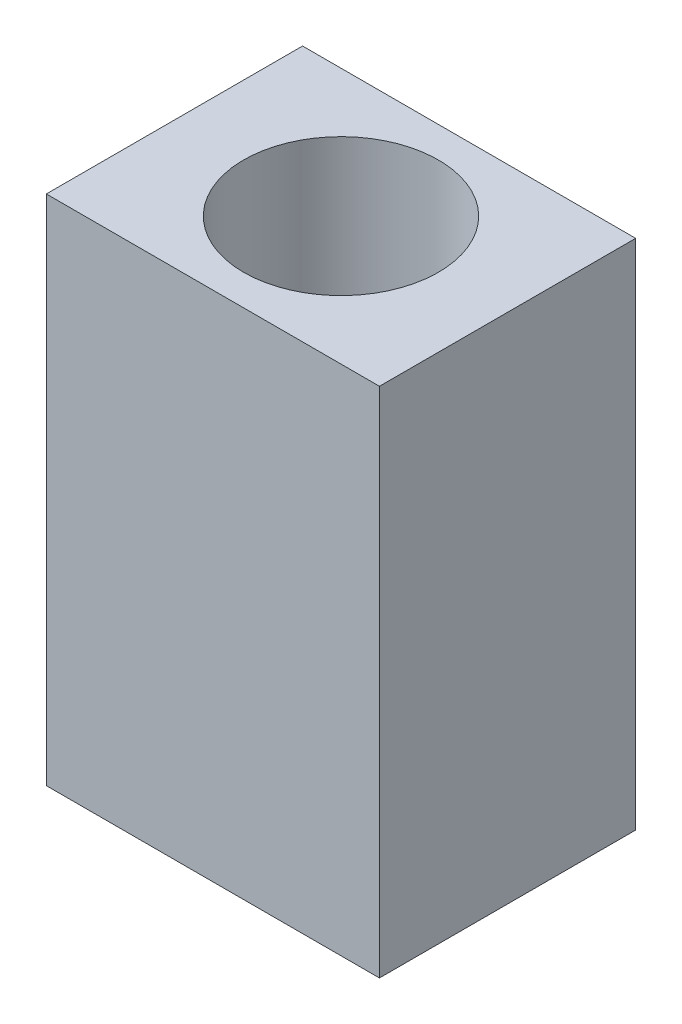
ISO-10303-21;
HEADER;
FILE_DESCRIPTION(('STEP AP214'),'2;1');
FILE_NAME('part.step','',(''),(''),'','','');
FILE_SCHEMA(('AUTOMOTIVE_DESIGN { 1 0 10303 214 1 1 1 1 }'));
ENDSEC;
DATA;
#1=APPLICATION_CONTEXT('core data for automotive mechanical design processes');
#2=APPLICATION_PROTOCOL_DEFINITION('international standard','automotive_design',2000,#1);
#3=PRODUCT_CONTEXT('',#1,'mechanical');
#4=PRODUCT('Part','Part','',(#3));
#5=PRODUCT_RELATED_PRODUCT_CATEGORY('part','',(#4));
#6=PRODUCT_DEFINITION_FORMATION('','',#4);
#7=PRODUCT_DEFINITION_CONTEXT('part definition',#1,'design');
#8=PRODUCT_DEFINITION('design','',#6,#7);
#9=PRODUCT_DEFINITION_SHAPE('','',#8);
#10=(LENGTH_UNIT() NAMED_UNIT(*) SI_UNIT(.MILLI.,.METRE.));
#11=(NAMED_UNIT(*) PLANE_ANGLE_UNIT() SI_UNIT($,.RADIAN.));
#12=(NAMED_UNIT(*) SI_UNIT($,.STERADIAN.) SOLID_ANGLE_UNIT());
#13=UNCERTAINTY_MEASURE_WITH_UNIT(LENGTH_MEASURE(1.E-05),#10,'distance_accuracy_value','');
#14=(GEOMETRIC_REPRESENTATION_CONTEXT(3) GLOBAL_UNCERTAINTY_ASSIGNED_CONTEXT((#13)) GLOBAL_UNIT_ASSIGNED_CONTEXT((#10,
#11,#12)) REPRESENTATION_CONTEXT('',''));
#15=CARTESIAN_POINT('',(0.,0.,0.));
#16=DIRECTION('',(0.,0.,1.));
#17=DIRECTION('',(1.,0.,0.));
#18=AXIS2_PLACEMENT_3D('',#15,#16,#17);
#19=CARTESIAN_POINT('',(0.,0.,10.));
#20=DIRECTION('',(1.,0.,0.));
#21=DIRECTION('',(0.,0.,-1.));
#22=AXIS2_PLACEMENT_3D('',#19,#20,#21);
#23=PLANE('',#22);
#24=DIRECTION('',(0.,-1.,0.));
#25=VECTOR('',#24,1.);
#26=CARTESIAN_POINT('',(0.,0.,0.));
#27=LINE('',#26,#25);
#28=CARTESIAN_POINT('',(0.,20.,0.));
#29=VERTEX_POINT('',#28);
#30=CARTESIAN_POINT('',(0.,0.,0.));
#31=VERTEX_POINT('',#30);
#32=EDGE_CURVE('E96',#29,#31,#27,.T.);
#33=ORIENTED_EDGE('',*,*,#32,.T.);
#34=DIRECTION('',(0.,0.,-1.));
#35=VECTOR('',#34,1.);
#36=CARTESIAN_POINT('',(0.,0.,10.));
#37=LINE('',#36,#35);
#38=CARTESIAN_POINT('',(0.,0.,10.));
#39=VERTEX_POINT('',#38);
#40=EDGE_CURVE('E11',#39,#31,#37,.T.);
#41=ORIENTED_EDGE('',*,*,#40,.F.);
#42=DIRECTION('',(0.,-1.,0.));
#43=VECTOR('',#42,1.);
#44=CARTESIAN_POINT('',(0.,0.,10.));
#45=LINE('',#44,#43);
#46=CARTESIAN_POINT('',(0.,20.,10.));
#47=VERTEX_POINT('',#46);
#48=EDGE_CURVE('E84',#47,#39,#45,.T.);
#49=ORIENTED_EDGE('',*,*,#48,.F.);
#50=DIRECTION('',(0.,0.,-1.));
#51=VECTOR('',#50,1.);
#52=CARTESIAN_POINT('',(0.,20.,10.));
#53=LINE('',#52,#51);
#54=EDGE_CURVE('E92',#47,#29,#53,.T.);
#55=ORIENTED_EDGE('',*,*,#54,.T.);
#56=EDGE_LOOP('',(#33,#41,#49,#55));
#57=FACE_BOUND('',#56,.T.);
#58=ADVANCED_FACE('F33',(#57),#23,.F.);
#59=CARTESIAN_POINT('',(0.,0.,10.));
#60=DIRECTION('',(0.,1.,0.));
#61=DIRECTION('',(0.,0.,1.));
#62=AXIS2_PLACEMENT_3D('',#59,#60,#61);
#63=PLANE('',#62);
#64=DIRECTION('',(1.,0.,0.));
#65=VECTOR('',#64,1.);
#66=CARTESIAN_POINT('',(0.,0.,0.));
#67=LINE('',#66,#65);
#68=CARTESIAN_POINT('',(13.,0.,0.));
#69=VERTEX_POINT('',#68);
#70=EDGE_CURVE('E88',#31,#69,#67,.T.);
#71=ORIENTED_EDGE('',*,*,#70,.T.);
#72=DIRECTION('',(0.,0.,-1.));
#73=VECTOR('',#72,1.);
#74=CARTESIAN_POINT('',(13.,0.,10.));
#75=LINE('',#74,#73);
#76=CARTESIAN_POINT('',(13.,0.,10.));
#77=VERTEX_POINT('',#76);
#78=EDGE_CURVE('E41',#77,#69,#75,.T.);
#79=ORIENTED_EDGE('',*,*,#78,.F.);
#80=DIRECTION('',(1.,0.,0.));
#81=VECTOR('',#80,1.);
#82=CARTESIAN_POINT('',(0.,0.,10.));
#83=LINE('',#82,#81);
#84=EDGE_CURVE('E79',#39,#77,#83,.T.);
#85=ORIENTED_EDGE('',*,*,#84,.F.);
#86=ORIENTED_EDGE('',*,*,#40,.T.);
#87=EDGE_LOOP('',(#71,#79,#85,#86));
#88=FACE_BOUND('',#87,.T.);
#89=ADVANCED_FACE('F87',(#88),#63,.F.);
#90=CARTESIAN_POINT('',(13.,0.,10.));
#91=DIRECTION('',(-1.,0.,0.));
#92=DIRECTION('',(0.,-1.,0.));
#93=AXIS2_PLACEMENT_3D('',#90,#91,#92);
#94=PLANE('',#93);
#95=DIRECTION('',(0.,1.,0.));
#96=VECTOR('',#95,1.);
#97=CARTESIAN_POINT('',(13.,0.,0.));
#98=LINE('',#97,#96);
#99=CARTESIAN_POINT('',(13.,20.,0.));
#100=VERTEX_POINT('',#99);
#101=EDGE_CURVE('E66',#69,#100,#98,.T.);
#102=ORIENTED_EDGE('',*,*,#101,.T.);
#103=DIRECTION('',(0.,0.,-1.));
#104=VECTOR('',#103,1.);
#105=CARTESIAN_POINT('',(13.,20.,10.));
#106=LINE('',#105,#104);
#107=CARTESIAN_POINT('',(13.,20.,10.));
#108=VERTEX_POINT('',#107);
#109=EDGE_CURVE('E89',#108,#100,#106,.T.);
#110=ORIENTED_EDGE('',*,*,#109,.F.);
#111=DIRECTION('',(0.,1.,0.));
#112=VECTOR('',#111,1.);
#113=CARTESIAN_POINT('',(13.,0.,10.));
#114=LINE('',#113,#112);
#115=EDGE_CURVE('E82',#77,#108,#114,.T.);
#116=ORIENTED_EDGE('',*,*,#115,.F.);
#117=ORIENTED_EDGE('',*,*,#78,.T.);
#118=EDGE_LOOP('',(#102,#110,#116,#117));
#119=FACE_BOUND('',#118,.T.);
#120=ADVANCED_FACE('F90',(#119),#94,.F.);
#121=CARTESIAN_POINT('',(0.,20.,10.));
#122=DIRECTION('',(0.,-1.,0.));
#123=DIRECTION('',(0.,0.,-1.));
#124=AXIS2_PLACEMENT_3D('',#121,#122,#123);
#125=PLANE('',#124);
#126=CARTESIAN_POINT('',(6.5,20.,5.));
#127=DIRECTION('',(0.,1.,0.));
#128=DIRECTION('',(0.,0.,1.));
#129=AXIS2_PLACEMENT_3D('',#126,#127,#128);
#130=CIRCLE('',#129,3.8);
#131=CARTESIAN_POINT('',(6.5,20.,8.8));
#132=VERTEX_POINT('',#131);
#133=EDGE_CURVE('E110',#132,#132,#130,.T.);
#134=ORIENTED_EDGE('',*,*,#133,.F.);
#135=EDGE_LOOP('',(#134));
#136=FACE_BOUND('',#135,.T.);
#137=DIRECTION('',(-1.,0.,0.));
#138=VECTOR('',#137,1.);
#139=CARTESIAN_POINT('',(0.,20.,0.));
#140=LINE('',#139,#138);
#141=EDGE_CURVE('E72',#100,#29,#140,.T.);
#142=ORIENTED_EDGE('',*,*,#141,.T.);
#143=ORIENTED_EDGE('',*,*,#54,.F.);
#144=DIRECTION('',(-1.,0.,0.));
#145=VECTOR('',#144,1.);
#146=CARTESIAN_POINT('',(0.,20.,10.));
#147=LINE('',#146,#145);
#148=EDGE_CURVE('E49',#108,#47,#147,.T.);
#149=ORIENTED_EDGE('',*,*,#148,.F.);
#150=ORIENTED_EDGE('',*,*,#109,.T.);
#151=EDGE_LOOP('',(#142,#143,#149,#150));
#152=FACE_BOUND('',#151,.T.);
#153=ADVANCED_FACE('F104',(#136,#152),#125,.F.);
#154=CARTESIAN_POINT('',(0.,0.,10.));
#155=DIRECTION('',(0.,0.,-1.));
#156=DIRECTION('',(-1.,0.,0.));
#157=AXIS2_PLACEMENT_3D('',#154,#155,#156);
#158=PLANE('',#157);
#159=ORIENTED_EDGE('',*,*,#48,.T.);
#160=ORIENTED_EDGE('',*,*,#84,.T.);
#161=ORIENTED_EDGE('',*,*,#115,.T.);
#162=ORIENTED_EDGE('',*,*,#148,.T.);
#163=EDGE_LOOP('',(#159,#160,#161,#162));
#164=FACE_BOUND('',#163,.T.);
#165=ADVANCED_FACE('F80',(#164),#158,.F.);
#166=CARTESIAN_POINT('',(0.,0.,0.));
#167=DIRECTION('',(0.,0.,-1.));
#168=DIRECTION('',(-1.,0.,0.));
#169=AXIS2_PLACEMENT_3D('',#166,#167,#168);
#170=PLANE('',#169);
#171=ORIENTED_EDGE('',*,*,#32,.F.);
#172=ORIENTED_EDGE('',*,*,#141,.F.);
#173=ORIENTED_EDGE('',*,*,#101,.F.);
#174=ORIENTED_EDGE('',*,*,#70,.F.);
#175=EDGE_LOOP('',(#171,#172,#173,#174));
#176=FACE_BOUND('',#175,.T.);
#177=ADVANCED_FACE('F107',(#176),#170,.T.);
#178=CARTESIAN_POINT('',(6.5,3.,5.));
#179=DIRECTION('',(0.,1.,0.));
#180=DIRECTION('',(0.,0.,1.));
#181=AXIS2_PLACEMENT_3D('',#178,#179,#180);
#182=CYLINDRICAL_SURFACE('',#181,3.8);
#183=CARTESIAN_POINT('',(6.5,3.,5.));
#184=DIRECTION('',(0.,1.,0.));
#185=DIRECTION('',(0.,0.,1.));
#186=AXIS2_PLACEMENT_3D('',#183,#184,#185);
#187=CIRCLE('',#186,3.8);
#188=CARTESIAN_POINT('',(6.5,3.,8.8));
#189=VERTEX_POINT('',#188);
#190=EDGE_CURVE('E99',#189,#189,#187,.T.);
#191=ORIENTED_EDGE('',*,*,#190,.F.);
#192=EDGE_LOOP('',(#191));
#193=FACE_BOUND('',#192,.T.);
#194=ORIENTED_EDGE('',*,*,#133,.T.);
#195=EDGE_LOOP('',(#194));
#196=FACE_BOUND('',#195,.T.);
#197=ADVANCED_FACE('F118',(#193,#196),#182,.F.);
#198=CARTESIAN_POINT('',(6.5,3.,5.));
#199=DIRECTION('',(0.,1.,0.));
#200=DIRECTION('',(0.,0.,1.));
#201=AXIS2_PLACEMENT_3D('',#198,#199,#200);
#202=PLANE('',#201);
#203=ORIENTED_EDGE('',*,*,#190,.T.);
#204=EDGE_LOOP('',(#203));
#205=FACE_BOUND('',#204,.T.);
#206=ADVANCED_FACE('F116',(#205),#202,.T.);
#207=CLOSED_SHELL('',(#58,#89,#120,#153,#165,#177,#197,#206));
#208=MANIFOLD_SOLID_BREP('B2',#207);
#209=ADVANCED_BREP_SHAPE_REPRESENTATION('',(#18,#208),#14);
#210=SHAPE_DEFINITION_REPRESENTATION(#9,#209);
ENDSEC;
END-ISO-10303-21;
